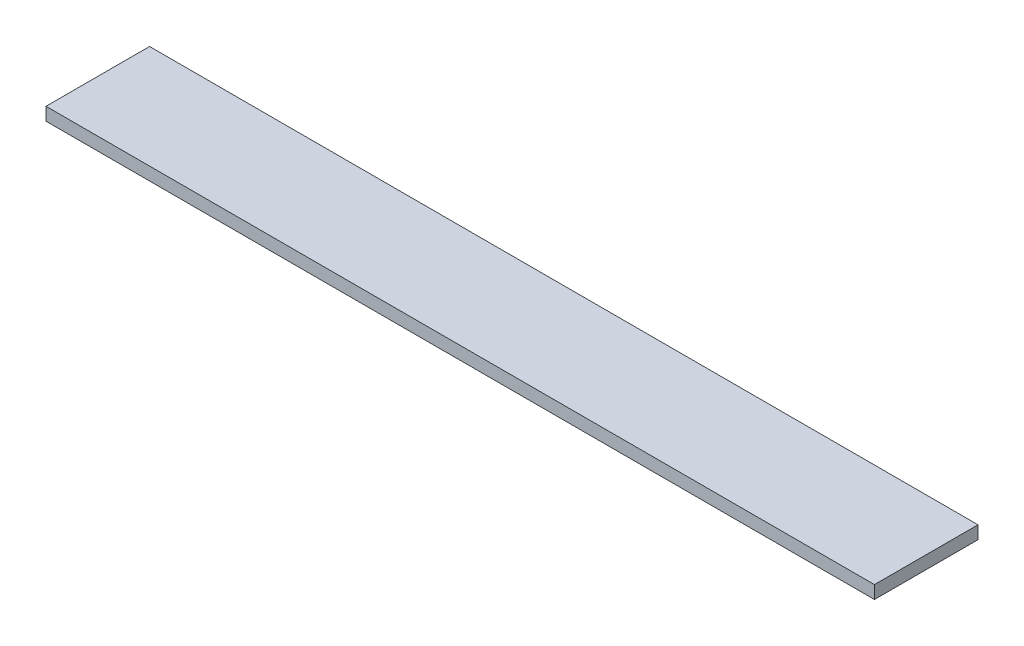
ISO-10303-21;
HEADER;
FILE_DESCRIPTION(('STEP AP214'),'2;1');
FILE_NAME('part.step','',(''),(''),'','','');
FILE_SCHEMA(('AUTOMOTIVE_DESIGN { 1 0 10303 214 1 1 1 1 }'));
ENDSEC;
DATA;
#1=APPLICATION_CONTEXT('core data for automotive mechanical design processes');
#2=APPLICATION_PROTOCOL_DEFINITION('international standard','automotive_design',2000,#1);
#3=PRODUCT_CONTEXT('',#1,'mechanical');
#4=PRODUCT('Part','Part','',(#3));
#5=PRODUCT_RELATED_PRODUCT_CATEGORY('part','',(#4));
#6=PRODUCT_DEFINITION_FORMATION('','',#4);
#7=PRODUCT_DEFINITION_CONTEXT('part definition',#1,'design');
#8=PRODUCT_DEFINITION('design','',#6,#7);
#9=PRODUCT_DEFINITION_SHAPE('','',#8);
#10=(LENGTH_UNIT() NAMED_UNIT(*) SI_UNIT(.MILLI.,.METRE.));
#11=(NAMED_UNIT(*) PLANE_ANGLE_UNIT() SI_UNIT($,.RADIAN.));
#12=(NAMED_UNIT(*) SI_UNIT($,.STERADIAN.) SOLID_ANGLE_UNIT());
#13=UNCERTAINTY_MEASURE_WITH_UNIT(LENGTH_MEASURE(1.E-05),#10,'distance_accuracy_value','');
#14=(GEOMETRIC_REPRESENTATION_CONTEXT(3) GLOBAL_UNCERTAINTY_ASSIGNED_CONTEXT((#13)) GLOBAL_UNIT_ASSIGNED_CONTEXT((#10,
#11,#12)) REPRESENTATION_CONTEXT('',''));
#15=CARTESIAN_POINT('',(0.,0.,0.));
#16=DIRECTION('',(0.,0.,1.));
#17=DIRECTION('',(1.,0.,0.));
#18=AXIS2_PLACEMENT_3D('',#15,#16,#17);
#19=CARTESIAN_POINT('',(0.,9.525,0.));
#20=DIRECTION('',(1.,0.,0.));
#21=DIRECTION('',(0.,0.,-1.));
#22=AXIS2_PLACEMENT_3D('',#19,#20,#21);
#23=PLANE('',#22);
#24=DIRECTION('',(0.,0.,1.));
#25=VECTOR('',#24,1.);
#26=CARTESIAN_POINT('',(0.,0.,0.));
#27=LINE('',#26,#25);
#28=CARTESIAN_POINT('',(0.,0.,-76.2));
#29=VERTEX_POINT('',#28);
#30=CARTESIAN_POINT('',(0.,0.,0.));
#31=VERTEX_POINT('',#30);
#32=EDGE_CURVE('E97',#29,#31,#27,.T.);
#33=ORIENTED_EDGE('',*,*,#32,.T.);
#34=DIRECTION('',(0.,-1.,0.));
#35=VECTOR('',#34,1.);
#36=CARTESIAN_POINT('',(0.,9.525,0.));
#37=LINE('',#36,#35);
#38=CARTESIAN_POINT('',(0.,9.525,0.));
#39=VERTEX_POINT('',#38);
#40=EDGE_CURVE('E11',#39,#31,#37,.T.);
#41=ORIENTED_EDGE('',*,*,#40,.F.);
#42=DIRECTION('',(0.,0.,1.));
#43=VECTOR('',#42,1.);
#44=CARTESIAN_POINT('',(0.,9.525,0.));
#45=LINE('',#44,#43);
#46=CARTESIAN_POINT('',(0.,9.525,-76.2));
#47=VERTEX_POINT('',#46);
#48=EDGE_CURVE('E85',#47,#39,#45,.T.);
#49=ORIENTED_EDGE('',*,*,#48,.F.);
#50=DIRECTION('',(0.,-1.,0.));
#51=VECTOR('',#50,1.);
#52=CARTESIAN_POINT('',(0.,9.525,-76.2));
#53=LINE('',#52,#51);
#54=EDGE_CURVE('E93',#47,#29,#53,.T.);
#55=ORIENTED_EDGE('',*,*,#54,.T.);
#56=EDGE_LOOP('',(#33,#41,#49,#55));
#57=FACE_BOUND('',#56,.T.);
#58=ADVANCED_FACE('F34',(#57),#23,.F.);
#59=CARTESIAN_POINT('',(0.,9.525,0.));
#60=DIRECTION('',(0.,0.,-1.));
#61=DIRECTION('',(-1.,0.,0.));
#62=AXIS2_PLACEMENT_3D('',#59,#60,#61);
#63=PLANE('',#62);
#64=DIRECTION('',(1.,0.,0.));
#65=VECTOR('',#64,1.);
#66=CARTESIAN_POINT('',(0.,0.,0.));
#67=LINE('',#66,#65);
#68=CARTESIAN_POINT('',(609.6,0.,0.));
#69=VERTEX_POINT('',#68);
#70=EDGE_CURVE('E89',#31,#69,#67,.T.);
#71=ORIENTED_EDGE('',*,*,#70,.T.);
#72=DIRECTION('',(0.,-1.,0.));
#73=VECTOR('',#72,1.);
#74=CARTESIAN_POINT('',(609.6,9.525,0.));
#75=LINE('',#74,#73);
#76=CARTESIAN_POINT('',(609.6,9.525,0.));
#77=VERTEX_POINT('',#76);
#78=EDGE_CURVE('E42',#77,#69,#75,.T.);
#79=ORIENTED_EDGE('',*,*,#78,.F.);
#80=DIRECTION('',(1.,0.,0.));
#81=VECTOR('',#80,1.);
#82=CARTESIAN_POINT('',(0.,9.525,0.));
#83=LINE('',#82,#81);
#84=EDGE_CURVE('E80',#39,#77,#83,.T.);
#85=ORIENTED_EDGE('',*,*,#84,.F.);
#86=ORIENTED_EDGE('',*,*,#40,.T.);
#87=EDGE_LOOP('',(#71,#79,#85,#86));
#88=FACE_BOUND('',#87,.T.);
#89=ADVANCED_FACE('F88',(#88),#63,.F.);
#90=CARTESIAN_POINT('',(609.6,9.525,0.));
#91=DIRECTION('',(-1.,0.,0.));
#92=DIRECTION('',(0.,0.,1.));
#93=AXIS2_PLACEMENT_3D('',#90,#91,#92);
#94=PLANE('',#93);
#95=DIRECTION('',(0.,0.,-1.));
#96=VECTOR('',#95,1.);
#97=CARTESIAN_POINT('',(609.6,0.,0.));
#98=LINE('',#97,#96);
#99=CARTESIAN_POINT('',(609.6,0.,-76.2));
#100=VERTEX_POINT('',#99);
#101=EDGE_CURVE('E67',#69,#100,#98,.T.);
#102=ORIENTED_EDGE('',*,*,#101,.T.);
#103=DIRECTION('',(0.,-1.,0.));
#104=VECTOR('',#103,1.);
#105=CARTESIAN_POINT('',(609.6,9.525,-76.2));
#106=LINE('',#105,#104);
#107=CARTESIAN_POINT('',(609.6,9.525,-76.2));
#108=VERTEX_POINT('',#107);
#109=EDGE_CURVE('E90',#108,#100,#106,.T.);
#110=ORIENTED_EDGE('',*,*,#109,.F.);
#111=DIRECTION('',(0.,0.,-1.));
#112=VECTOR('',#111,1.);
#113=CARTESIAN_POINT('',(609.6,9.525,0.));
#114=LINE('',#113,#112);
#115=EDGE_CURVE('E83',#77,#108,#114,.T.);
#116=ORIENTED_EDGE('',*,*,#115,.F.);
#117=ORIENTED_EDGE('',*,*,#78,.T.);
#118=EDGE_LOOP('',(#102,#110,#116,#117));
#119=FACE_BOUND('',#118,.T.);
#120=ADVANCED_FACE('F91',(#119),#94,.F.);
#121=CARTESIAN_POINT('',(0.,9.525,-76.2));
#122=DIRECTION('',(0.,0.,1.));
#123=DIRECTION('',(1.,0.,0.));
#124=AXIS2_PLACEMENT_3D('',#121,#122,#123);
#125=PLANE('',#124);
#126=DIRECTION('',(-1.,0.,0.));
#127=VECTOR('',#126,1.);
#128=CARTESIAN_POINT('',(0.,0.,-76.2));
#129=LINE('',#128,#127);
#130=EDGE_CURVE('E73',#100,#29,#129,.T.);
#131=ORIENTED_EDGE('',*,*,#130,.T.);
#132=ORIENTED_EDGE('',*,*,#54,.F.);
#133=DIRECTION('',(-1.,0.,0.));
#134=VECTOR('',#133,1.);
#135=CARTESIAN_POINT('',(0.,9.525,-76.2));
#136=LINE('',#135,#134);
#137=EDGE_CURVE('E50',#108,#47,#136,.T.);
#138=ORIENTED_EDGE('',*,*,#137,.F.);
#139=ORIENTED_EDGE('',*,*,#109,.T.);
#140=EDGE_LOOP('',(#131,#132,#138,#139));
#141=FACE_BOUND('',#140,.T.);
#142=ADVANCED_FACE('F104',(#141),#125,.F.);
#143=CARTESIAN_POINT('',(0.,9.525,-76.2));
#144=DIRECTION('',(0.,-1.,0.));
#145=DIRECTION('',(0.,0.,-1.));
#146=AXIS2_PLACEMENT_3D('',#143,#144,#145);
#147=PLANE('',#146);
#148=ORIENTED_EDGE('',*,*,#48,.T.);
#149=ORIENTED_EDGE('',*,*,#84,.T.);
#150=ORIENTED_EDGE('',*,*,#115,.T.);
#151=ORIENTED_EDGE('',*,*,#137,.T.);
#152=EDGE_LOOP('',(#148,#149,#150,#151));
#153=FACE_BOUND('',#152,.T.);
#154=ADVANCED_FACE('F81',(#153),#147,.F.);
#155=CARTESIAN_POINT('',(0.,0.,-76.2));
#156=DIRECTION('',(0.,-1.,0.));
#157=DIRECTION('',(0.,0.,-1.));
#158=AXIS2_PLACEMENT_3D('',#155,#156,#157);
#159=PLANE('',#158);
#160=ORIENTED_EDGE('',*,*,#32,.F.);
#161=ORIENTED_EDGE('',*,*,#130,.F.);
#162=ORIENTED_EDGE('',*,*,#101,.F.);
#163=ORIENTED_EDGE('',*,*,#70,.F.);
#164=EDGE_LOOP('',(#160,#161,#162,#163));
#165=FACE_BOUND('',#164,.T.);
#166=ADVANCED_FACE('F107',(#165),#159,.T.);
#167=CLOSED_SHELL('',(#58,#89,#120,#142,#154,#166));
#168=MANIFOLD_SOLID_BREP('B2',#167);
#169=ADVANCED_BREP_SHAPE_REPRESENTATION('',(#18,#168),#14);
#170=SHAPE_DEFINITION_REPRESENTATION(#9,#169);
ENDSEC;
END-ISO-10303-21;
